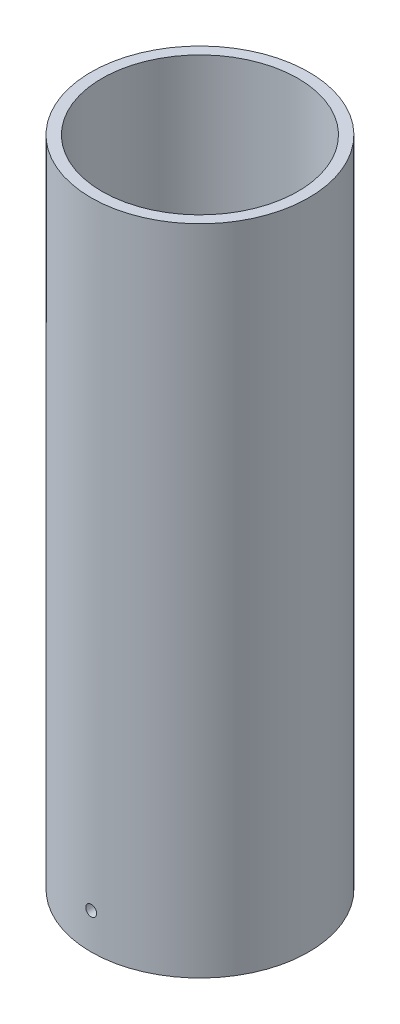
ISO-10303-21;
HEADER;
FILE_DESCRIPTION(('STEP AP214'),'2;1');
FILE_NAME('part.step','',(''),(''),'','','');
FILE_SCHEMA(('AUTOMOTIVE_DESIGN { 1 0 10303 214 1 1 1 1 }'));
ENDSEC;
DATA;
#1=APPLICATION_CONTEXT('core data for automotive mechanical design processes');
#2=APPLICATION_PROTOCOL_DEFINITION('international standard','automotive_design',2000,#1);
#3=PRODUCT_CONTEXT('',#1,'mechanical');
#4=PRODUCT('Part','Part','',(#3));
#5=PRODUCT_RELATED_PRODUCT_CATEGORY('part','',(#4));
#6=PRODUCT_DEFINITION_FORMATION('','',#4);
#7=PRODUCT_DEFINITION_CONTEXT('part definition',#1,'design');
#8=PRODUCT_DEFINITION('design','',#6,#7);
#9=PRODUCT_DEFINITION_SHAPE('','',#8);
#10=(LENGTH_UNIT() NAMED_UNIT(*) SI_UNIT(.MILLI.,.METRE.));
#11=(NAMED_UNIT(*) PLANE_ANGLE_UNIT() SI_UNIT($,.RADIAN.));
#12=(NAMED_UNIT(*) SI_UNIT($,.STERADIAN.) SOLID_ANGLE_UNIT());
#13=UNCERTAINTY_MEASURE_WITH_UNIT(LENGTH_MEASURE(1.E-05),#10,'distance_accuracy_value','');
#14=(GEOMETRIC_REPRESENTATION_CONTEXT(3) GLOBAL_UNCERTAINTY_ASSIGNED_CONTEXT((#13)) GLOBAL_UNIT_ASSIGNED_CONTEXT((#10,
#11,#12)) REPRESENTATION_CONTEXT('',''));
#15=CARTESIAN_POINT('',(0.,0.,0.));
#16=DIRECTION('',(0.,0.,1.));
#17=DIRECTION('',(1.,0.,0.));
#18=AXIS2_PLACEMENT_3D('',#15,#16,#17);
#19=CARTESIAN_POINT('',(0.,180.,0.));
#20=DIRECTION('',(0.,-1.,0.));
#21=DIRECTION('',(0.,0.,-1.));
#22=AXIS2_PLACEMENT_3D('',#19,#20,#21);
#23=CYLINDRICAL_SURFACE('',#22,25.);
#24=CARTESIAN_POINT('',(0.,0.,0.));
#25=DIRECTION('',(0.,1.,0.));
#26=DIRECTION('',(0.,0.,1.));
#27=AXIS2_PLACEMENT_3D('',#24,#25,#26);
#28=CIRCLE('',#27,25.);
#29=CARTESIAN_POINT('',(0.,0.,25.));
#30=VERTEX_POINT('',#29);
#31=EDGE_CURVE('E45',#30,#30,#28,.T.);
#32=ORIENTED_EDGE('',*,*,#31,.F.);
#33=EDGE_LOOP('',(#32));
#34=FACE_BOUND('',#33,.T.);
#35=CARTESIAN_POINT('',(1.5,9.9,24.9549594269356));
#36=CARTESIAN_POINT('',(1.49999629367853,9.81582574249602,24.9549600300317));
#37=CARTESIAN_POINT('',(1.49289088723917,9.73159238147982,24.9553898919632));
#38=CARTESIAN_POINT('',(1.46464774207902,9.5654510762883,24.9570631163396));
#39=CARTESIAN_POINT('',(1.44349362662339,9.48354596251271,24.9583074281733));
#40=CARTESIAN_POINT('',(1.38776244497562,9.32449180928827,24.9614681027881));
#41=CARTESIAN_POINT('',(1.35319241127323,9.24734030255802,24.9633841134208));
#42=CARTESIAN_POINT('',(1.27162196187011,9.09995549274731,24.9676718488877));
#43=CARTESIAN_POINT('',(1.22462441159698,9.02972060001151,24.9700434686372));
#44=CARTESIAN_POINT('',(1.11946088204271,8.89804433305085,24.9749789472156));
#45=CARTESIAN_POINT('',(1.06128123877002,8.83661387943003,24.9775430388755));
#46=CARTESIAN_POINT('',(0.935433067856954,8.7243836690896,24.9825723731579));
#47=CARTESIAN_POINT('',(0.867764146481715,8.67358435370169,24.9850376116732));
#48=CARTESIAN_POINT('',(0.72479767520839,8.58402565895638,24.9895934208353));
#49=CARTESIAN_POINT('',(0.649494533535974,8.54527519065056,24.9916837136997));
#50=CARTESIAN_POINT('',(0.493436451566955,8.4809712580593,24.9952516671057));
#51=CARTESIAN_POINT('',(0.412681565907557,8.45541766153744,24.9967293337859));
#52=CARTESIAN_POINT('',(0.248116432778312,8.41826280439247,24.9989039357683));
#53=CARTESIAN_POINT('',(0.164310019372327,8.40664461835363,24.999601818096));
#54=CARTESIAN_POINT('',(-0.00406619674097704,8.39763811906782,25.0001414004183));
#55=CARTESIAN_POINT('',(-0.088635991399465,8.40024965596207,24.9999831094297));
#56=CARTESIAN_POINT('',(-0.25602370910129,8.41961449104253,24.9988289734266));
#57=CARTESIAN_POINT('',(-0.338843747190689,8.43634958015796,24.9978342068609));
#58=CARTESIAN_POINT('',(-0.500497005824335,8.48345822133699,24.9951203677711));
#59=CARTESIAN_POINT('',(-0.579330204279495,8.5138318489557,24.9934012912345));
#60=CARTESIAN_POINT('',(-0.730830489828712,8.58737602146978,24.9894305509762));
#61=CARTESIAN_POINT('',(-0.803493557011333,8.63055482803961,24.987178543607));
#62=CARTESIAN_POINT('',(-0.94054703371884,8.72847765519807,24.9823954231729));
#63=CARTESIAN_POINT('',(-1.00493735768537,8.7832217953822,24.9798643072219));
#64=CARTESIAN_POINT('',(-1.12372380476943,8.90282416709277,24.9748031593022));
#65=CARTESIAN_POINT('',(-1.1781040176493,8.96769820191484,24.972273135328));
#66=CARTESIAN_POINT('',(-1.27520394033667,9.10566342735353,24.9675033967138));
#67=CARTESIAN_POINT('',(-1.3179236458803,9.17875462097487,24.96526368218));
#68=CARTESIAN_POINT('',(-1.39048870924375,9.33108937503987,24.9613274543607));
#69=CARTESIAN_POINT('',(-1.42033341256492,9.41033324801242,24.9596309686913));
#70=CARTESIAN_POINT('',(-1.46629038294869,9.57271934659457,24.9569735139226));
#71=CARTESIAN_POINT('',(-1.48240279883676,9.65586152994541,24.9560125368521));
#72=CARTESIAN_POINT('',(-1.50041803122797,9.82354540576911,24.9549359603509));
#73=CARTESIAN_POINT('',(-1.502342956535,9.90808471489413,24.9548190455977));
#74=CARTESIAN_POINT('',(-1.49198631615381,10.0762850405415,24.9554403428122));
#75=CARTESIAN_POINT('',(-1.47970481851039,10.1599460612687,24.9561785506842));
#76=CARTESIAN_POINT('',(-1.44130231806505,10.3239525508928,24.9584256981138));
#77=CARTESIAN_POINT('',(-1.41519148386754,10.4043004092052,24.9599340713456));
#78=CARTESIAN_POINT('',(-1.34988179901679,10.5594735122598,24.9635510809282));
#79=CARTESIAN_POINT('',(-1.31068283898678,10.634298710843,24.9656597222954));
#80=CARTESIAN_POINT('',(-1.2202530665563,10.7764040714476,24.9702428271324));
#81=CARTESIAN_POINT('',(-1.16900743202449,10.8436747865983,24.9727177398586));
#82=CARTESIAN_POINT('',(-1.05596057652178,10.9686664769422,24.9777529022322));
#83=CARTESIAN_POINT('',(-0.994159260021297,11.0263873656994,24.9803131526518));
#84=CARTESIAN_POINT('',(-0.861660242357588,11.1307155140826,24.9852343171827));
#85=CARTESIAN_POINT('',(-0.790951269706828,11.1773084725469,24.9875949722934));
#86=CARTESIAN_POINT('',(-0.642700853338525,11.2579603164173,24.9918472173968));
#87=CARTESIAN_POINT('',(-0.565159449081161,11.2920192742066,24.9937388100983));
#88=CARTESIAN_POINT('',(-0.405497997606176,11.3466114035117,24.9968385433506));
#89=CARTESIAN_POINT('',(-0.323381061721332,11.3671536474445,24.9980471422498));
#90=CARTESIAN_POINT('',(-0.156856221762156,11.3941589249725,24.9996465260776));
#91=CARTESIAN_POINT('',(-0.0724483381394147,11.4006220842116,25.0000373183046));
#92=CARTESIAN_POINT('',(0.0961207332461768,11.3992845201593,24.9999570780358));
#93=CARTESIAN_POINT('',(0.180282100246809,11.3915061889346,24.9994873984695));
#94=CARTESIAN_POINT('',(0.346101569050353,11.3619528395094,24.9977417270832));
#95=CARTESIAN_POINT('',(0.42775966637549,11.3401777962734,24.9964657338211));
#96=CARTESIAN_POINT('',(0.58625825076941,11.2832540983733,24.9932508853364));
#97=CARTESIAN_POINT('',(0.663098754536598,11.2481054900667,24.9913120324117));
#98=CARTESIAN_POINT('',(0.809790494584377,11.1654356440707,24.9869892318681));
#99=CARTESIAN_POINT('',(0.879641919304419,11.1179147400875,24.9846052962545));
#100=CARTESIAN_POINT('',(1.01048596126016,11.0117669143717,24.9796560975471));
#101=CARTESIAN_POINT('',(1.07146551413196,10.9531239014044,24.9770905751506));
#102=CARTESIAN_POINT('',(1.18273513562141,10.8264163054458,24.9720693720982));
#103=CARTESIAN_POINT('',(1.23302258152254,10.7583494175739,24.969613718509));
#104=CARTESIAN_POINT('',(1.32151476133076,10.614653755024,24.9650870313927));
#105=CARTESIAN_POINT('',(1.35970517585709,10.5390161570939,24.9630164548729));
#106=CARTESIAN_POINT('',(1.42279802241095,10.3824453801455,24.9595002684231));
#107=CARTESIAN_POINT('',(1.44771604662734,10.3015185409405,24.9580539255344));
#108=CARTESIAN_POINT('',(1.47706733648901,10.166745746732,24.9563297281718));
#109=CARTESIAN_POINT('',(1.48565599553077,10.1137713651314,24.9558181549229));
#110=CARTESIAN_POINT('',(1.49712350402984,10.0072059814227,24.9551328124479));
#111=CARTESIAN_POINT('',(1.50000236074968,9.95361498009906,24.9549590427922));
#112=CARTESIAN_POINT('',(1.5,9.9,24.9549594269356));
#113=B_SPLINE_CURVE_WITH_KNOTS('',3,(#35,#36,#37,#38,#39,#40,#41,#42,#43,#44,#45,#46,#47,#48,
#49,#50,#51,#52,#53,#54,#55,#56,#57,#58,#59,#60,#61,#62,#63,#64,#65,#66,#67,#68,#69,#70,#71,#72,
#73,#74,#75,#76,#77,#78,#79,#80,#81,#82,#83,#84,#85,#86,#87,#88,#89,#90,#91,#92,#93,#94,#95,#96,
#97,#98,#99,#100,#101,#102,#103,#104,#105,#106,#107,#108,#109,#110,#111,#112),.UNSPECIFIED.,.T.,
.F.,(4,2,2,2,2,2,2,2,2,2,2,2,2,2,2,2,2,2,2,2,2,2,2,2,2,2,2,2,2,2,2,2,2,2,2,2,2,2,4),(0.,
0.252327047205416,0.504948752345388,0.75743821419937,1.00986950993718,1.26261124881181,
1.51536347770391,1.76830219416346,2.02123837605553,2.27386703926161,2.52649304194187,
2.7787938382088,3.0310960321953,3.28356136253979,3.53602930372083,3.78889512066045,
4.04176103006473,4.29463979235217,4.54751581399805,4.79999768766214,5.05247835201362,
5.30477362648828,5.55707100943362,5.8096804569925,6.06229219080376,6.3152268447135,
6.56816003791442,6.82092328873071,7.073684283838,7.32604820102929,7.57841256961534,
7.83077606342532,8.08313275117977,8.33585736760379,8.58864390468439,8.84172855917086,
9.09451523445984,9.25523571151606,9.41595598414494),.UNSPECIFIED.);
#114=CARTESIAN_POINT('',(1.5,9.9,24.9549594269356));
#115=VERTEX_POINT('',#114);
#116=EDGE_CURVE('E50',#115,#115,#113,.T.);
#117=ORIENTED_EDGE('',*,*,#116,.F.);
#118=EDGE_LOOP('',(#117));
#119=FACE_BOUND('',#118,.T.);
#120=CARTESIAN_POINT('',(0.,11.4,-25.));
#121=CARTESIAN_POINT('',(-0.0841744112906983,11.399996293818,-24.9999994009396));
#122=CARTESIAN_POINT('',(-0.168407925575419,11.3928908622938,-24.9995703322505));
#123=CARTESIAN_POINT('',(-0.334549549235282,11.3646476084302,-24.9978999420123));
#124=CARTESIAN_POINT('',(-0.416454828330711,11.3434934098783,-24.9966576725644));
#125=CARTESIAN_POINT('',(-0.575509331027304,11.2877619851162,-24.9935014300757));
#126=CARTESIAN_POINT('',(-0.652661020509568,11.2531917874331,-24.9915878088006));
#127=CARTESIAN_POINT('',(-0.800046136146104,11.1716209519445,-24.9873041548427));
#128=CARTESIAN_POINT('',(-0.870281152186776,11.1246231799728,-24.9849342274195));
#129=CARTESIAN_POINT('',(-1.00195727834146,11.0194594271275,-24.9800007098428));
#130=CARTESIAN_POINT('',(-1.06338750728241,10.9612798317275,-24.9774368859408));
#131=CARTESIAN_POINT('',(-1.17561728443769,10.835431850684,-24.9724065327507));
#132=CARTESIAN_POINT('',(-1.22641639063195,10.767763070695,-24.9699400075116));
#133=CARTESIAN_POINT('',(-1.31597486784904,10.6247967217378,-24.9653806252969));
#134=CARTESIAN_POINT('',(-1.35472528905779,10.5494935366959,-24.9632880465787));
#135=CARTESIAN_POINT('',(-1.41902912258917,10.3934353604241,-24.9597155336563));
#136=CARTESIAN_POINT('',(-1.44458266771712,10.3126804240666,-24.9582355932868));
#137=CARTESIAN_POINT('',(-1.48173741565119,10.1481151420652,-24.9560574575134));
#138=CARTESIAN_POINT('',(-1.49335553999938,10.0643086296343,-24.9553583140724));
#139=CARTESIAN_POINT('',(-1.50236188160073,9.89593222010211,-24.954817773996));
#140=CARTESIAN_POINT('',(-1.49975024936642,9.81136233108476,-24.954976368288));
#141=CARTESIAN_POINT('',(-1.48038526467146,9.64397503742043,-24.9561325386846));
#142=CARTESIAN_POINT('',(-1.46365021721639,9.56115550653042,-24.9571290288072));
#143=CARTESIAN_POINT('',(-1.41654183568936,9.39950324083169,-24.9598469788447));
#144=CARTESIAN_POINT('',(-1.38616842513186,9.32067052838429,-24.9615684428253));
#145=CARTESIAN_POINT('',(-1.31262469930025,9.1691708267964,-24.9655435872457));
#146=CARTESIAN_POINT('',(-1.26944607125189,9.0965078824264,-24.9677976132153));
#147=CARTESIAN_POINT('',(-1.17152362364147,8.95945457537002,-24.9725835122349));
#148=CARTESIAN_POINT('',(-1.11677968459202,8.89506429816404,-24.9751153881552));
#149=CARTESIAN_POINT('',(-0.997177453913967,8.77627761892122,-24.9801764756538));
#150=CARTESIAN_POINT('',(-0.93230331834646,8.72189716787369,-24.9827056767018));
#151=CARTESIAN_POINT('',(-0.79433780707835,8.62479681289598,-24.9874725341813));
#152=CARTESIAN_POINT('',(-0.721246428711385,8.58207691274946,-24.9897101905182));
#153=CARTESIAN_POINT('',(-0.568911628096272,8.50951170999266,-24.9936419598513));
#154=CARTESIAN_POINT('',(-0.489667922304732,8.47966700117968,-24.9953360477775));
#155=CARTESIAN_POINT('',(-0.327282186584158,8.4337099684282,-24.9979894319355));
#156=CARTESIAN_POINT('',(-0.244140198631619,8.4175974966575,-24.9989487360774));
#157=CARTESIAN_POINT('',(-0.0764564081212679,8.3995820540376,-25.0000234317371));
#158=CARTESIAN_POINT('',(0.00808301680837843,8.39765702742457,-25.000140133157));
#159=CARTESIAN_POINT('',(0.176283598525668,8.40801350654288,-24.9995199551995));
#160=CARTESIAN_POINT('',(0.259944759518493,8.42029494422147,-24.998783079911));
#161=CARTESIAN_POINT('',(0.423951918612621,8.45869746639442,-24.9965395546253));
#162=CARTESIAN_POINT('',(0.504300292000613,8.48480844226628,-24.9950334669082));
#163=CARTESIAN_POINT('',(0.659474362375062,8.55011858331961,-24.991420983828));
#164=CARTESIAN_POINT('',(0.734300013552596,8.58931785704872,-24.9893145834861));
#165=CARTESIAN_POINT('',(0.876405673907386,8.67974808630051,-24.9847349543981));
#166=CARTESIAN_POINT('',(0.943676287014675,8.73099378415315,-24.9822612775589));
#167=CARTESIAN_POINT('',(1.06866774190153,8.84404070840916,-24.9772270256052));
#168=CARTESIAN_POINT('',(1.12638849680831,8.90584203082413,-24.9746664497003));
#169=CARTESIAN_POINT('',(1.23071636822773,9.03834098829924,-24.9697432142549));
#170=CARTESIAN_POINT('',(1.27730918435509,9.10904989414342,-24.9673808118859));
#171=CARTESIAN_POINT('',(1.35796077823129,9.25730014010787,-24.9631244152043));
#172=CARTESIAN_POINT('',(1.3920196283509,9.33484144077489,-24.9612304181871));
#173=CARTESIAN_POINT('',(1.44661168369628,9.49450296761392,-24.9581262710517));
#174=CARTESIAN_POINT('',(1.46715391475467,9.57662009841355,-24.9569156646707));
#175=CARTESIAN_POINT('',(1.49415910044394,9.74314534845835,-24.9553135506001));
#176=CARTESIAN_POINT('',(1.50062218175197,9.82755344708362,-24.9549220355407));
#177=CARTESIAN_POINT('',(1.49928439559964,9.99612237484442,-24.9550024337275));
#178=CARTESIAN_POINT('',(1.4915060131671,10.0802833839978,-24.955472985906));
#179=CARTESIAN_POINT('',(1.46195268745906,10.2461021246323,-24.9572216088909));
#180=CARTESIAN_POINT('',(1.44017771850783,10.3277598515209,-24.9584996811785));
#181=CARTESIAN_POINT('',(1.38325430313316,10.486257712021,-24.9617189844004));
#182=CARTESIAN_POINT('',(1.34810590374647,10.5630978625757,-24.9636602130021));
#183=CARTESIAN_POINT('',(1.26543658450866,10.7097889837536,-24.9679870227359));
#184=CARTESIAN_POINT('',(1.21791599798011,10.7796401425991,-24.9703725918963));
#185=CARTESIAN_POINT('',(1.11176851558594,10.9104842139973,-24.9753236195898));
#186=CARTESIAN_POINT('',(1.05312545630152,10.9714640037111,-24.9778893364568));
#187=CARTESIAN_POINT('',(0.926417671082018,11.0827340813544,-24.9829093861692));
#188=CARTESIAN_POINT('',(0.858350640782176,11.1330217471789,-24.9853636915766));
#189=CARTESIAN_POINT('',(0.714654868135349,11.221514157026,-24.9898867196811));
#190=CARTESIAN_POINT('',(0.639017327934046,11.2597046229485,-24.9919549855695));
#191=CARTESIAN_POINT('',(0.482446674586145,11.3227975817096,-24.9954666177913));
#192=CARTESIAN_POINT('',(0.4015199009218,11.3477156659503,-24.9969107169712));
#193=CARTESIAN_POINT('',(0.266746945425285,11.3770671292626,-24.9986320978355));
#194=CARTESIAN_POINT('',(0.213772324734722,11.3856558662585,-24.9991427869583));
#195=CARTESIAN_POINT('',(0.10720646174047,11.3971234783516,-24.9998269286143));
#196=CARTESIAN_POINT('',(0.0536152202163849,11.4000023606671,-25.0000003815739));
#197=CARTESIAN_POINT('',(0.,11.4,-25.));
#198=B_SPLINE_CURVE_WITH_KNOTS('',3,(#120,#121,#122,#123,#124,#125,#126,#127,#128,#129,#130,
#131,#132,#133,#134,#135,#136,#137,#138,#139,#140,#141,#142,#143,#144,#145,#146,#147,#148,#149,
#150,#151,#152,#153,#154,#155,#156,#157,#158,#159,#160,#161,#162,#163,#164,#165,#166,#167,#168,
#169,#170,#171,#172,#173,#174,#175,#176,#177,#178,#179,#180,#181,#182,#183,#184,#185,#186,#187,
#188,#189,#190,#191,#192,#193,#194,#195,#196,#197),.UNSPECIFIED.,.T.,.F.,(4,2,2,2,2,2,2,2,2,2,2,
2,2,2,2,2,2,2,2,2,2,2,2,2,2,2,2,2,2,2,2,2,2,2,2,2,2,2,4),(0.,0.252327509077058,
0.504949665992948,0.75743965459485,1.00987146898756,1.26261260362568,1.51536424463011,
1.76830318456221,2.02123957902125,2.2738685252172,2.52649479928369,2.77879415269303,
3.03109492104444,3.28355983557363,3.5360273585799,3.78889377835762,4.04176028018661,
4.29463844284425,4.54751388314839,4.79999612089073,5.05247714918094,5.30477388207097,
5.55707270743328,5.80968191670639,6.06229342377881,6.31522783298447,6.56816078173093,
6.82092466056901,7.07368626515456,7.32604914306343,7.57841248391496,7.83077493716774,
8.08313059215601,8.33585582543017,8.58864296499112,8.84172736228352,9.0945137955507,
9.25523499170706,9.41595598468315),.UNSPECIFIED.);
#199=CARTESIAN_POINT('',(0.,11.4,-25.));
#200=VERTEX_POINT('',#199);
#201=EDGE_CURVE('E56',#200,#200,#198,.T.);
#202=ORIENTED_EDGE('',*,*,#201,.F.);
#203=EDGE_LOOP('',(#202));
#204=FACE_BOUND('',#203,.T.);
#205=CARTESIAN_POINT('',(0.,19.9999999999999,0.));
#206=DIRECTION('',(0.,1.,0.));
#207=DIRECTION('',(0.,0.,1.));
#208=AXIS2_PLACEMENT_3D('',#205,#206,#207);
#209=CIRCLE('',#208,25.);
#210=CARTESIAN_POINT('',(0.,19.9999999999999,25.));
#211=VERTEX_POINT('',#210);
#212=EDGE_CURVE('E36',#211,#211,#209,.T.);
#213=ORIENTED_EDGE('',*,*,#212,.T.);
#214=EDGE_LOOP('',(#213));
#215=FACE_BOUND('',#214,.T.);
#216=ADVANCED_FACE('F31',(#34,#119,#204,#215),#23,.F.);
#217=CARTESIAN_POINT('',(0.,180.,0.));
#218=DIRECTION('',(0.,1.,0.));
#219=DIRECTION('',(0.,0.,1.));
#220=AXIS2_PLACEMENT_3D('',#217,#218,#219);
#221=PLANE('',#220);
#222=CARTESIAN_POINT('',(0.,180.,0.));
#223=DIRECTION('',(0.,1.,0.));
#224=DIRECTION('',(0.,0.,1.));
#225=AXIS2_PLACEMENT_3D('',#222,#223,#224);
#226=CIRCLE('',#225,27.);
#227=CARTESIAN_POINT('',(0.,180.,27.));
#228=VERTEX_POINT('',#227);
#229=EDGE_CURVE('E79',#228,#228,#226,.T.);
#230=ORIENTED_EDGE('',*,*,#229,.F.);
#231=EDGE_LOOP('',(#230));
#232=FACE_BOUND('',#231,.T.);
#233=CARTESIAN_POINT('',(0.,180.,0.));
#234=DIRECTION('',(0.,1.,0.));
#235=DIRECTION('',(0.,0.,1.));
#236=AXIS2_PLACEMENT_3D('',#233,#234,#235);
#237=CIRCLE('',#236,30.);
#238=CARTESIAN_POINT('',(0.,180.,30.));
#239=VERTEX_POINT('',#238);
#240=EDGE_CURVE('E10',#239,#239,#237,.T.);
#241=ORIENTED_EDGE('',*,*,#240,.T.);
#242=EDGE_LOOP('',(#241));
#243=FACE_BOUND('',#242,.T.);
#244=ADVANCED_FACE('F93',(#232,#243),#221,.T.);
#245=CARTESIAN_POINT('',(0.,0.,0.));
#246=DIRECTION('',(0.,1.,0.));
#247=DIRECTION('',(0.,0.,1.));
#248=AXIS2_PLACEMENT_3D('',#245,#246,#247);
#249=PLANE('',#248);
#250=CARTESIAN_POINT('',(0.,0.,0.));
#251=DIRECTION('',(0.,1.,0.));
#252=DIRECTION('',(0.,0.,1.));
#253=AXIS2_PLACEMENT_3D('',#250,#251,#252);
#254=CIRCLE('',#253,30.);
#255=CARTESIAN_POINT('',(0.,0.,30.));
#256=VERTEX_POINT('',#255);
#257=EDGE_CURVE('E40',#256,#256,#254,.T.);
#258=ORIENTED_EDGE('',*,*,#257,.F.);
#259=EDGE_LOOP('',(#258));
#260=FACE_BOUND('',#259,.T.);
#261=ORIENTED_EDGE('',*,*,#31,.T.);
#262=EDGE_LOOP('',(#261));
#263=FACE_BOUND('',#262,.T.);
#264=ADVANCED_FACE('F89',(#260,#263),#249,.F.);
#265=CARTESIAN_POINT('',(0.,180.,0.));
#266=DIRECTION('',(0.,-1.,0.));
#267=DIRECTION('',(0.,0.,-1.));
#268=AXIS2_PLACEMENT_3D('',#265,#266,#267);
#269=CYLINDRICAL_SURFACE('',#268,30.);
#270=CARTESIAN_POINT('',(0.,11.4,-30.));
#271=CARTESIAN_POINT('',(-0.0841992126832865,11.3999962840396,-29.9999994982941));
#272=CARTESIAN_POINT('',(-0.168458136850034,11.3928866817366,-29.9996417281926));
#273=CARTESIAN_POINT('',(-0.334651580227572,11.3646258947893,-29.9982489069002));
#274=CARTESIAN_POINT('',(-0.416583242008779,11.3434581659315,-29.9972130577371));
#275=CARTESIAN_POINT('',(-0.5756906375655,11.2876886958403,-29.994581319066));
#276=CARTESIAN_POINT('',(-0.652868771917124,11.2530938009858,-29.9929857150113));
#277=CARTESIAN_POINT('',(-0.800301559187851,11.1714625403052,-29.9894141701653));
#278=CARTESIAN_POINT('',(-0.87055784111193,11.1244291114388,-29.987438319187));
#279=CARTESIAN_POINT('',(-1.00224448930937,11.0192029919437,-29.9833263203305));
#280=CARTESIAN_POINT('',(-1.06366700108493,10.9610004763932,-29.9811900323378));
#281=CARTESIAN_POINT('',(-1.1758756183212,10.835107951495,-29.9769991403279));
#282=CARTESIAN_POINT('',(-1.22666128928588,10.7674175547728,-29.9749445396501));
#283=CARTESIAN_POINT('',(-1.3161762583419,10.6244295509778,-29.9711477201023));
#284=CARTESIAN_POINT('',(-1.35489942324752,10.5491280997483,-29.969405660334));
#285=CARTESIAN_POINT('',(-1.41915082297219,10.3930825776006,-29.9664320766967));
#286=CARTESIAN_POINT('',(-1.44467915792307,10.3123385479899,-29.9652005489535));
#287=CARTESIAN_POINT('',(-1.4817954922831,10.1477721448386,-29.9633881722544));
#288=CARTESIAN_POINT('',(-1.4933952428733,10.0639524277984,-29.9628067748292));
#289=CARTESIAN_POINT('',(-1.5023613905524,9.89555366389491,-29.9623585750058));
#290=CARTESIAN_POINT('',(-1.49972789996418,9.8109746230292,-29.9624917669684));
#291=CARTESIAN_POINT('',(-1.48031211001844,9.64353797565118,-29.9634572162788));
#292=CARTESIAN_POINT('',(-1.46354250774894,9.56067889267852,-29.9642888462857));
#293=CARTESIAN_POINT('',(-1.41635019807595,9.39895332894273,-29.9665564507146));
#294=CARTESIAN_POINT('',(-1.38592743297957,9.32008686505241,-29.9679924276905));
#295=CARTESIAN_POINT('',(-1.31227788828427,9.16854436690631,-29.9713076019097));
#296=CARTESIAN_POINT('',(-1.26904531998985,9.09587115051147,-29.9731869994545));
#297=CARTESIAN_POINT('',(-1.17100760081353,8.95880889495858,-29.9771769840148));
#298=CARTESIAN_POINT('',(-1.11620236826096,8.89441991426926,-29.9792875726618));
#299=CARTESIAN_POINT('',(-0.996503387931564,8.77567999508416,-29.9835048437456));
#300=CARTESIAN_POINT('',(-0.931598644778625,8.72134013991282,-29.9856115193623));
#301=CARTESIAN_POINT('',(-0.793581693926331,8.62432638662726,-29.9895812923529));
#302=CARTESIAN_POINT('',(-0.720469484208145,8.58165249138259,-29.9914443896669));
#303=CARTESIAN_POINT('',(-0.568106505265407,8.50918307666531,-29.9947171137912));
#304=CARTESIAN_POINT('',(-0.488855551783038,8.47938794393271,-29.9961267269834));
#305=CARTESIAN_POINT('',(-0.326467606273836,8.43352907355052,-29.9983334185069));
#306=CARTESIAN_POINT('',(-0.243330643343608,8.41746523310486,-29.9991305014237));
#307=CARTESIAN_POINT('',(-0.0756268510814779,8.39953860112714,-30.0000217103255));
#308=CARTESIAN_POINT('',(0.00893833568201721,8.39766047938959,-30.0001165951587));
#309=CARTESIAN_POINT('',(0.177182660650749,8.40811859109897,-29.9995947289365));
#310=CARTESIAN_POINT('',(0.260861801785492,8.42045477753472,-29.9989779802346));
#311=CARTESIAN_POINT('',(0.424915732818912,8.45897863792114,-29.9971028015194));
#312=CARTESIAN_POINT('',(0.505292170445177,8.48515931212933,-29.9958446957863));
#313=CARTESIAN_POINT('',(0.660509858247265,8.55062187780918,-29.992828448663));
#314=CARTESIAN_POINT('',(0.735351076557827,8.58990384469545,-29.9910703043943));
#315=CARTESIAN_POINT('',(0.87744424784483,8.68049317325427,-29.9872498726375));
#316=CARTESIAN_POINT('',(0.944689642216208,8.73181081127804,-29.9851873258042));
#317=CARTESIAN_POINT('',(1.06961637025234,8.84499974827068,-29.9809912358893));
#318=CARTESIAN_POINT('',(1.12729764255457,8.90687111494612,-29.9788576923523));
#319=CARTESIAN_POINT('',(1.2315103771602,9.03947715629033,-29.9747579179097));
#320=CARTESIAN_POINT('',(1.27803192066247,9.1102196312279,-29.9727918368387));
#321=CARTESIAN_POINT('',(1.35853682885391,9.25852035428337,-29.9692510482457));
#322=CARTESIAN_POINT('',(1.39252024811012,9.33607857273671,-29.9676763390205));
#323=CARTESIAN_POINT('',(1.44696694942588,9.49577244253631,-29.9650969361268));
#324=CARTESIAN_POINT('',(1.46743655476016,9.57790593352137,-29.9640919758971));
#325=CARTESIAN_POINT('',(1.49429525271083,9.74444911401301,-29.9627646470903));
#326=CARTESIAN_POINT('',(1.50068442526798,9.82885879059394,-29.9624422746379));
#327=CARTESIAN_POINT('',(1.49920013162778,9.99745952364509,-29.9625165709538));
#328=CARTESIAN_POINT('',(1.49134226953531,10.0816507182812,-29.9629124530521));
#329=CARTESIAN_POINT('',(1.46161921750531,10.2475169829771,-29.9643769772704));
#330=CARTESIAN_POINT('',(1.43975400087197,10.3291920482411,-29.9654456206724));
#331=CARTESIAN_POINT('',(1.38264009901717,10.4877108698946,-29.968135046136));
#332=CARTESIAN_POINT('',(1.34739131557652,10.5645545908229,-29.9697558322496));
#333=CARTESIAN_POINT('',(1.2645135593488,10.7112343250962,-29.9733668169471));
#334=CARTESIAN_POINT('',(1.21688496641684,10.7810705533641,-29.9753570041959));
#335=CARTESIAN_POINT('',(1.11054372547874,10.9118308417719,-29.9794849660002));
#336=CARTESIAN_POINT('',(1.05182020091046,10.9727460515701,-29.9816228840632));
#337=CARTESIAN_POINT('',(0.924963179847303,11.0838725394719,-29.9858043365659));
#338=CARTESIAN_POINT('',(0.856827371947793,11.1340811806016,-29.9878478476567));
#339=CARTESIAN_POINT('',(0.713026426964386,11.222392770467,-29.9916116284693));
#340=CARTESIAN_POINT('',(0.637354138093168,11.2604840738536,-29.9933315865963));
#341=CARTESIAN_POINT('',(0.480736308807684,11.3233754378123,-29.9962497906235));
#342=CARTESIAN_POINT('',(0.399797124433939,11.3481911973825,-29.9974486524302));
#343=CARTESIAN_POINT('',(0.26529588902732,11.3773178227492,-29.9988724803088));
#344=CARTESIAN_POINT('',(0.212605024212696,11.385812779862,-29.9992934419966));
#345=CARTESIAN_POINT('',(0.106617421258441,11.3971550426777,-29.9998573605808));
#346=CARTESIAN_POINT('',(0.0533206836358213,11.4000023531996,-30.0000003177144));
#347=CARTESIAN_POINT('',(0.,11.4,-30.));
#348=B_SPLINE_CURVE_WITH_KNOTS('',3,(#270,#271,#272,#273,#274,#275,#276,#277,#278,#279,#280,
#281,#282,#283,#284,#285,#286,#287,#288,#289,#290,#291,#292,#293,#294,#295,#296,#297,#298,#299,
#300,#301,#302,#303,#304,#305,#306,#307,#308,#309,#310,#311,#312,#313,#314,#315,#316,#317,#318,
#319,#320,#321,#322,#323,#324,#325,#326,#327,#328,#329,#330,#331,#332,#333,#334,#335,#336,#337,
#338,#339,#340,#341,#342,#343,#344,#345,#346,#347),.UNSPECIFIED.,.T.,.F.,(4,2,2,2,2,2,2,2,2,2,2,
2,2,2,2,2,2,2,2,2,2,2,2,2,2,2,2,2,2,2,2,2,2,2,2,2,2,2,4),(0.,0.252402997656369,
0.505103561718775,0.7576754451813,1.01018774508169,1.26292319493205,1.51566896656381,
1.76854303790938,2.02141519023714,2.27407385073242,2.52673051735231,2.7791604886842,
3.03159152669596,3.28413681164743,3.53668387892216,3.78950784409648,4.04233187145931,
4.29516349041915,4.5479932165984,4.80054967590646,5.05310529993359,5.30553335431042,
5.55796286175701,5.81060868943829,6.06325613800909,6.31612731523398,6.56899739192782,
6.82174906367759,7.07449930044228,7.3269728790031,7.57944693874013,7.83192285136708,
8.08439101807935,8.33710798029887,8.58988711372659,8.84290845133273,9.09562991333957,
9.25546884106145,9.41530763239779),.UNSPECIFIED.);
#349=CARTESIAN_POINT('',(0.,11.4,-30.));
#350=VERTEX_POINT('',#349);
#351=EDGE_CURVE('E78',#350,#350,#348,.T.);
#352=ORIENTED_EDGE('',*,*,#351,.T.);
#353=EDGE_LOOP('',(#352));
#354=FACE_BOUND('',#353,.T.);
#355=CARTESIAN_POINT('',(1.5,9.9,29.9624765331573));
#356=CARTESIAN_POINT('',(1.49999628397222,9.81580086150497,29.9624770372162));
#357=CARTESIAN_POINT('',(1.49288669377387,9.73154201127373,29.962835266608));
#358=CARTESIAN_POINT('',(1.46462595928152,9.56534872152329,29.9642297287393));
#359=CARTESIAN_POINT('',(1.44345827052283,9.48341713949153,29.9652667603156));
#360=CARTESIAN_POINT('',(1.38768891775242,9.32430991251044,29.9679010652108));
#361=CARTESIAN_POINT('',(1.35309410203283,9.24713186630945,29.9694980528928));
#362=CARTESIAN_POINT('',(1.271463027665,9.09969922652003,29.9730719610605));
#363=CARTESIAN_POINT('',(1.22442970578001,9.02944300403836,29.975048791834));
#364=CARTESIAN_POINT('',(1.1192036939777,8.89775628782395,29.9791619233031));
#365=CARTESIAN_POINT('',(1.06100115527481,8.83633366763087,29.9812983637162));
#366=CARTESIAN_POINT('',(0.93510853867131,8.72412484140337,29.985488661235));
#367=CARTESIAN_POINT('',(0.867418073690438,8.67333906953291,29.9875425149671));
#368=CARTESIAN_POINT('',(0.724430010979663,8.58382399565718,29.9913372650751));
#369=CARTESIAN_POINT('',(0.649128580822738,8.54510080811049,29.9930780025459));
#370=CARTESIAN_POINT('',(0.493083104497863,8.48084936070071,29.9960489494894));
#371=CARTESIAN_POINT('',(0.412339099524103,8.45532100098023,29.9972791628257));
#372=CARTESIAN_POINT('',(0.247772768188905,8.41820461382668,29.9990894967281));
#373=CARTESIAN_POINT('',(0.163953098728565,8.40660483340009,29.9996701653544));
#374=CARTESIAN_POINT('',(-0.00444557228203016,8.39763860956657,30.0001178121798));
#375=CARTESIAN_POINT('',(-0.0890245678515672,8.40027205415178,29.9999847959953));
#376=CARTESIAN_POINT('',(-0.256461420139639,8.41968777202017,29.9990205243754));
#377=CARTESIAN_POINT('',(-0.339320747918154,8.43645739450254,29.9981898932546));
#378=CARTESIAN_POINT('',(-0.501046790855104,8.48364982975444,29.9959246714313));
#379=CARTESIAN_POINT('',(-0.579913489272554,8.51407269976638,29.9944900781967));
#380=CARTESIAN_POINT('',(-0.731456268769945,8.58772246012796,29.991177454681));
#381=CARTESIAN_POINT('',(-0.804129544029278,8.63095511443547,29.9892992248562));
#382=CARTESIAN_POINT('',(-0.941191880683596,8.7289930163536,29.9853108458067));
#383=CARTESIAN_POINT('',(-1.00558088357129,8.78379834568847,29.9832006949442));
#384=CARTESIAN_POINT('',(-1.12432069061591,8.90349739374138,29.978983382249));
#385=CARTESIAN_POINT('',(-1.178660431069,8.96840208831534,29.9768762262153));
#386=CARTESIAN_POINT('',(-1.27567397617904,9.1064189014372,29.9729047794271));
#387=CARTESIAN_POINT('',(-1.31834777773623,9.17953102216589,29.9710404887371));
#388=CARTESIAN_POINT('',(-1.39081712539269,9.33189397898568,29.9677651844501));
#389=CARTESIAN_POINT('',(-1.42061225547781,9.41114501328194,29.966354185496));
#390=CARTESIAN_POINT('',(-1.46647109571371,9.57353313415029,29.9641451427563));
#391=CARTESIAN_POINT('',(-1.48253490913895,9.6566701914903,29.9633470943607));
#392=CARTESIAN_POINT('',(-1.50046143951967,9.82437402449913,29.9624548008175));
#393=CARTESIAN_POINT('',(-1.50233951237468,9.90893915484596,29.9623597946373));
#394=CARTESIAN_POINT('',(-1.49188132304581,10.0771833551685,29.9628823125091));
#395=CARTESIAN_POINT('',(-1.47954510786832,10.1608624280734,29.9634998342048));
#396=CARTESIAN_POINT('',(-1.44102125848948,10.3249160357454,29.9653771125877));
#397=CARTESIAN_POINT('',(-1.41484065287852,10.4052922250422,29.9666365433754));
#398=CARTESIAN_POINT('',(-1.34937830775901,10.5605094466212,29.9696554135577));
#399=CARTESIAN_POINT('',(-1.31009649243498,10.6353504468688,29.9714148558457));
#400=CARTESIAN_POINT('',(-1.21950738416592,10.7774434744792,29.9752372960101));
#401=CARTESIAN_POINT('',(-1.16818977630626,10.8446889186455,29.9773005536947));
#402=CARTESIAN_POINT('',(-1.05500087152025,10.9696157612423,29.981497160644));
#403=CARTESIAN_POINT('',(-0.993129507121334,11.0272970985227,29.9836305103568));
#404=CARTESIAN_POINT('',(-0.860523436418344,11.1315099665688,29.9877290769785));
#405=CARTESIAN_POINT('',(-0.789780929636859,11.1780315783069,29.9896941433233));
#406=CARTESIAN_POINT('',(-0.641480125358402,11.2585366063708,29.9932325258126));
#407=CARTESIAN_POINT('',(-0.563921857527848,11.2925200772669,29.994805843662));
#408=CARTESIAN_POINT('',(-0.40422802456372,11.3469668143062,29.9973826962819));
#409=CARTESIAN_POINT('',(-0.322094627416059,11.3674364260568,29.9983864984446));
#410=CARTESIAN_POINT('',(-0.155551644264921,11.3942951686611,29.9997122550948));
#411=CARTESIAN_POINT('',(-0.0711420711067391,11.400684378959,30.0000342134294));
#412=CARTESIAN_POINT('',(0.0974587323412745,11.3992001924303,29.9999600152463));
#413=CARTESIAN_POINT('',(0.181650100387103,11.3913423547829,29.999564642125));
#414=CARTESIAN_POINT('',(0.347516717827453,11.3616192904981,29.9981018331539));
#415=CARTESIAN_POINT('',(0.429191962482231,11.339754037476,29.9970343960382));
#416=CARTESIAN_POINT('',(0.587711133113285,11.2826399984748,29.9943475524905));
#417=CARTESIAN_POINT('',(0.664555023593042,11.247391114178,29.9927281420037));
#418=CARTESIAN_POINT('',(0.81123505466916,11.1645131039952,29.9891194758232));
#419=CARTESIAN_POINT('',(0.88107141029245,11.1168843581477,29.9871302314832));
#420=CARTESIAN_POINT('',(1.01183168334708,11.0105429523416,29.9830033176299));
#421=CARTESIAN_POINT('',(1.07274677865547,10.9518194505526,29.9808655042371));
#422=CARTESIAN_POINT('',(1.18387304623981,10.8249625216858,29.9766833697048));
#423=CARTESIAN_POINT('',(1.23408158124698,10.7568267829553,29.9746390716975));
#424=CARTESIAN_POINT('',(1.32239306067115,10.6130258909328,29.9708731658307));
#425=CARTESIAN_POINT('',(1.3604843396651,10.5373535735403,29.9691518695786));
#426=CARTESIAN_POINT('',(1.42337565004508,10.3807356831098,29.9662310322912));
#427=CARTESIAN_POINT('',(1.44819138081059,10.2997964662724,29.9650308752857));
#428=CARTESIAN_POINT('',(1.4773179225833,10.1652953083114,29.9636054274165));
#429=CARTESIAN_POINT('',(1.48581284214325,10.1126045593118,29.9631839590812));
#430=CARTESIAN_POINT('',(1.49715505505153,10.006617188546,29.9626193524688));
#431=CARTESIAN_POINT('',(1.50000235323915,9.95332056729914,29.9624762139532));
#432=CARTESIAN_POINT('',(1.5,9.9,29.9624765331573));
#433=B_SPLINE_CURVE_WITH_KNOTS('',3,(#355,#356,#357,#358,#359,#360,#361,#362,#363,#364,#365,
#366,#367,#368,#369,#370,#371,#372,#373,#374,#375,#376,#377,#378,#379,#380,#381,#382,#383,#384,
#385,#386,#387,#388,#389,#390,#391,#392,#393,#394,#395,#396,#397,#398,#399,#400,#401,#402,#403,
#404,#405,#406,#407,#408,#409,#410,#411,#412,#413,#414,#415,#416,#417,#418,#419,#420,#421,#422,
#423,#424,#425,#426,#427,#428,#429,#430,#431,#432),.UNSPECIFIED.,.T.,.F.,(4,2,2,2,2,2,2,2,2,2,2,
2,2,2,2,2,2,2,2,2,2,2,2,2,2,2,2,2,2,2,2,2,2,2,2,2,2,2,4),(0.,0.252402774850887,
0.505103120966063,0.757674750307552,1.01018679999478,1.2629225413087,1.51566859652119,
1.76854255964547,2.02141460901224,2.27407313360386,2.52672966991109,2.77916033764387,
3.03159206372378,3.28413754825082,3.53668481627066,3.78950849136502,4.04233223363706,
4.29516414215493,4.54799414908479,4.80055043119031,5.05310587809921,5.30553322930183,
5.55796204130353,5.81060798549991,6.06325554497973,6.3161268383656,6.5689970311533,
6.82174840085848,7.0744983444935,7.32697242654597,7.57944698416684,7.83192339653087,
8.08439205925959,8.33710872331969,8.58988756550599,8.84290902947146,9.09563061048889,
9.2554691897848,9.415307632119),.UNSPECIFIED.);
#434=CARTESIAN_POINT('',(1.5,9.9,29.9624765331573));
#435=VERTEX_POINT('',#434);
#436=EDGE_CURVE('E73',#435,#435,#433,.T.);
#437=ORIENTED_EDGE('',*,*,#436,.T.);
#438=EDGE_LOOP('',(#437));
#439=FACE_BOUND('',#438,.T.);
#440=ORIENTED_EDGE('',*,*,#240,.F.);
#441=EDGE_LOOP('',(#440));
#442=FACE_BOUND('',#441,.T.);
#443=ORIENTED_EDGE('',*,*,#257,.T.);
#444=EDGE_LOOP('',(#443));
#445=FACE_BOUND('',#444,.T.);
#446=ADVANCED_FACE('F33',(#354,#439,#442,#445),#269,.T.);
#447=CARTESIAN_POINT('',(0.,9.9,-30.));
#448=DIRECTION('',(0.,0.,1.));
#449=DIRECTION('',(1.,0.,0.));
#450=AXIS2_PLACEMENT_3D('',#447,#448,#449);
#451=CYLINDRICAL_SURFACE('',#450,1.5);
#452=ORIENTED_EDGE('',*,*,#116,.T.);
#453=EDGE_LOOP('',(#452));
#454=FACE_BOUND('',#453,.T.);
#455=ORIENTED_EDGE('',*,*,#436,.F.);
#456=EDGE_LOOP('',(#455));
#457=FACE_BOUND('',#456,.T.);
#458=ADVANCED_FACE('F66',(#454,#457),#451,.F.);
#459=ORIENTED_EDGE('',*,*,#201,.T.);
#460=EDGE_LOOP('',(#459));
#461=FACE_BOUND('',#460,.T.);
#462=ORIENTED_EDGE('',*,*,#351,.F.);
#463=EDGE_LOOP('',(#462));
#464=FACE_BOUND('',#463,.T.);
#465=ADVANCED_FACE('F61',(#461,#464),#451,.F.);
#466=CARTESIAN_POINT('',(0.,19.9999999999999,0.));
#467=DIRECTION('',(0.,1.,0.));
#468=DIRECTION('',(0.,0.,1.));
#469=AXIS2_PLACEMENT_3D('',#466,#467,#468);
#470=CYLINDRICAL_SURFACE('',#469,27.);
#471=CARTESIAN_POINT('',(0.,19.9999999999999,0.));
#472=DIRECTION('',(0.,1.,0.));
#473=DIRECTION('',(0.,0.,1.));
#474=AXIS2_PLACEMENT_3D('',#471,#472,#473);
#475=CIRCLE('',#474,27.);
#476=CARTESIAN_POINT('',(0.,19.9999999999999,27.));
#477=VERTEX_POINT('',#476);
#478=EDGE_CURVE('E102',#477,#477,#475,.T.);
#479=ORIENTED_EDGE('',*,*,#478,.F.);
#480=EDGE_LOOP('',(#479));
#481=FACE_BOUND('',#480,.T.);
#482=ORIENTED_EDGE('',*,*,#229,.T.);
#483=EDGE_LOOP('',(#482));
#484=FACE_BOUND('',#483,.T.);
#485=ADVANCED_FACE('F65',(#481,#484),#470,.F.);
#486=CARTESIAN_POINT('',(0.,19.9999999999999,0.));
#487=DIRECTION('',(0.,1.,0.));
#488=DIRECTION('',(0.,0.,1.));
#489=AXIS2_PLACEMENT_3D('',#486,#487,#488);
#490=PLANE('',#489);
#491=ORIENTED_EDGE('',*,*,#212,.F.);
#492=EDGE_LOOP('',(#491));
#493=FACE_BOUND('',#492,.T.);
#494=ORIENTED_EDGE('',*,*,#478,.T.);
#495=EDGE_LOOP('',(#494));
#496=FACE_BOUND('',#495,.T.);
#497=ADVANCED_FACE('F146',(#493,#496),#490,.T.);
#498=CLOSED_SHELL('',(#216,#244,#264,#446,#458,#465,#485,#497));
#499=MANIFOLD_SOLID_BREP('B2',#498);
#500=ADVANCED_BREP_SHAPE_REPRESENTATION('',(#18,#499),#14);
#501=SHAPE_DEFINITION_REPRESENTATION(#9,#500);
ENDSEC;
END-ISO-10303-21;
